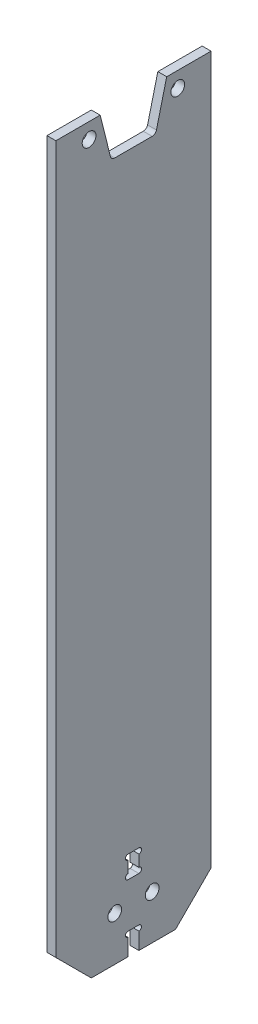
ISO-10303-21;
HEADER;
FILE_DESCRIPTION(('STEP AP214'),'2;1');
FILE_NAME('part.step','',(''),(''),'','','');
FILE_SCHEMA(('AUTOMOTIVE_DESIGN { 1 0 10303 214 1 1 1 1 }'));
ENDSEC;
DATA;
#1=APPLICATION_CONTEXT('core data for automotive mechanical design processes');
#2=APPLICATION_PROTOCOL_DEFINITION('international standard','automotive_design',2000,#1);
#3=PRODUCT_CONTEXT('',#1,'mechanical');
#4=PRODUCT('Part','Part','',(#3));
#5=PRODUCT_RELATED_PRODUCT_CATEGORY('part','',(#4));
#6=PRODUCT_DEFINITION_FORMATION('','',#4);
#7=PRODUCT_DEFINITION_CONTEXT('part definition',#1,'design');
#8=PRODUCT_DEFINITION('design','',#6,#7);
#9=PRODUCT_DEFINITION_SHAPE('','',#8);
#10=(LENGTH_UNIT() NAMED_UNIT(*) SI_UNIT(.MILLI.,.METRE.));
#11=(NAMED_UNIT(*) PLANE_ANGLE_UNIT() SI_UNIT($,.RADIAN.));
#12=(NAMED_UNIT(*) SI_UNIT($,.STERADIAN.) SOLID_ANGLE_UNIT());
#13=UNCERTAINTY_MEASURE_WITH_UNIT(LENGTH_MEASURE(1.E-05),#10,'distance_accuracy_value','');
#14=(GEOMETRIC_REPRESENTATION_CONTEXT(3) GLOBAL_UNCERTAINTY_ASSIGNED_CONTEXT((#13)) GLOBAL_UNIT_ASSIGNED_CONTEXT((#10,
#11,#12)) REPRESENTATION_CONTEXT('',''));
#15=CARTESIAN_POINT('',(0.,0.,0.));
#16=DIRECTION('',(0.,0.,1.));
#17=DIRECTION('',(1.,0.,0.));
#18=AXIS2_PLACEMENT_3D('',#15,#16,#17);
#19=CARTESIAN_POINT('',(1.,83.75,-17.5));
#20=DIRECTION('',(0.,-1.,0.));
#21=DIRECTION('',(0.,0.,-1.));
#22=AXIS2_PLACEMENT_3D('',#19,#20,#21);
#23=PLANE('',#22);
#24=DIRECTION('',(0.,0.,1.));
#25=VECTOR('',#24,1.);
#26=CARTESIAN_POINT('',(1.,83.75,-17.5));
#27=LINE('',#26,#25);
#28=CARTESIAN_POINT('',(1.,83.75,7.5));
#29=VERTEX_POINT('',#28);
#30=CARTESIAN_POINT('',(1.,83.75,17.5));
#31=VERTEX_POINT('',#30);
#32=EDGE_CURVE('E379',#29,#31,#27,.T.);
#33=ORIENTED_EDGE('',*,*,#32,.F.);
#34=DIRECTION('',(1.,0.,0.));
#35=VECTOR('',#34,1.);
#36=CARTESIAN_POINT('',(-1.,83.75,7.5));
#37=LINE('',#36,#35);
#38=CARTESIAN_POINT('',(-1.,83.75,7.5));
#39=VERTEX_POINT('',#38);
#40=EDGE_CURVE('E226',#39,#29,#37,.T.);
#41=ORIENTED_EDGE('',*,*,#40,.F.);
#42=DIRECTION('',(0.,0.,1.));
#43=VECTOR('',#42,1.);
#44=CARTESIAN_POINT('',(-1.,83.75,-17.5));
#45=LINE('',#44,#43);
#46=CARTESIAN_POINT('',(-1.,83.75,17.5));
#47=VERTEX_POINT('',#46);
#48=EDGE_CURVE('E233',#39,#47,#45,.T.);
#49=ORIENTED_EDGE('',*,*,#48,.T.);
#50=DIRECTION('',(-1.,0.,0.));
#51=VECTOR('',#50,1.);
#52=CARTESIAN_POINT('',(1.,83.75,17.5));
#53=LINE('',#52,#51);
#54=EDGE_CURVE('E242',#31,#47,#53,.T.);
#55=ORIENTED_EDGE('',*,*,#54,.F.);
#56=EDGE_LOOP('',(#33,#41,#49,#55));
#57=FACE_BOUND('',#56,.T.);
#58=ADVANCED_FACE('F37',(#57),#23,.F.);
#59=CARTESIAN_POINT('',(1.,-83.75,-17.5));
#60=DIRECTION('',(0.,1.,0.));
#61=DIRECTION('',(0.,0.,1.));
#62=AXIS2_PLACEMENT_3D('',#59,#60,#61);
#63=PLANE('',#62);
#64=DIRECTION('',(0.,0.,-1.));
#65=VECTOR('',#64,1.);
#66=CARTESIAN_POINT('',(1.,-83.75,-17.5));
#67=LINE('',#66,#65);
#68=CARTESIAN_POINT('',(1.,-83.75,9.49999999999999));
#69=VERTEX_POINT('',#68);
#70=CARTESIAN_POINT('',(1.,-83.75,1.22499999999987));
#71=VERTEX_POINT('',#70);
#72=EDGE_CURVE('E370',#69,#71,#67,.T.);
#73=ORIENTED_EDGE('',*,*,#72,.F.);
#74=DIRECTION('',(-1.,0.,0.));
#75=VECTOR('',#74,1.);
#76=CARTESIAN_POINT('',(1.,-83.75,9.49999999999999));
#77=LINE('',#76,#75);
#78=CARTESIAN_POINT('',(-1.,-83.75,9.49999999999999));
#79=VERTEX_POINT('',#78);
#80=EDGE_CURVE('E272',#69,#79,#77,.T.);
#81=ORIENTED_EDGE('',*,*,#80,.T.);
#82=DIRECTION('',(0.,0.,-1.));
#83=VECTOR('',#82,1.);
#84=CARTESIAN_POINT('',(-1.,-83.75,-17.5));
#85=LINE('',#84,#83);
#86=CARTESIAN_POINT('',(-1.,-83.75,1.22499999999987));
#87=VERTEX_POINT('',#86);
#88=EDGE_CURVE('E389',#79,#87,#85,.T.);
#89=ORIENTED_EDGE('',*,*,#88,.T.);
#90=DIRECTION('',(1.,0.,0.));
#91=VECTOR('',#90,1.);
#92=CARTESIAN_POINT('',(-1.,-83.75,1.22499999999987));
#93=LINE('',#92,#91);
#94=EDGE_CURVE('E376',#87,#71,#93,.T.);
#95=ORIENTED_EDGE('',*,*,#94,.T.);
#96=EDGE_LOOP('',(#73,#81,#89,#95));
#97=FACE_BOUND('',#96,.T.);
#98=ADVANCED_FACE('F314',(#97),#63,.F.);
#99=CARTESIAN_POINT('',(1.,-83.75,17.5));
#100=DIRECTION('',(0.,0.,-1.));
#101=DIRECTION('',(-1.,0.,0.));
#102=AXIS2_PLACEMENT_3D('',#99,#100,#101);
#103=PLANE('',#102);
#104=DIRECTION('',(0.,-1.,0.));
#105=VECTOR('',#104,1.);
#106=CARTESIAN_POINT('',(-1.,-83.75,17.5));
#107=LINE('',#106,#105);
#108=CARTESIAN_POINT('',(-1.,-75.75,17.5));
#109=VERTEX_POINT('',#108);
#110=EDGE_CURVE('E385',#47,#109,#107,.T.);
#111=ORIENTED_EDGE('',*,*,#110,.T.);
#112=DIRECTION('',(1.,0.,0.));
#113=VECTOR('',#112,1.);
#114=CARTESIAN_POINT('',(1.,-75.75,17.5));
#115=LINE('',#114,#113);
#116=CARTESIAN_POINT('',(1.,-75.75,17.5));
#117=VERTEX_POINT('',#116);
#118=EDGE_CURVE('E275',#109,#117,#115,.T.);
#119=ORIENTED_EDGE('',*,*,#118,.T.);
#120=DIRECTION('',(0.,-1.,0.));
#121=VECTOR('',#120,1.);
#122=CARTESIAN_POINT('',(1.,-83.75,17.5));
#123=LINE('',#122,#121);
#124=EDGE_CURVE('E232',#31,#117,#123,.T.);
#125=ORIENTED_EDGE('',*,*,#124,.F.);
#126=ORIENTED_EDGE('',*,*,#54,.T.);
#127=EDGE_LOOP('',(#111,#119,#125,#126));
#128=FACE_BOUND('',#127,.T.);
#129=ADVANCED_FACE('F320',(#128),#103,.F.);
#130=CARTESIAN_POINT('',(-1.,-83.75,-1.22499999999987));
#131=VERTEX_POINT('',#130);
#132=CARTESIAN_POINT('',(-1.,-83.75,-9.49999999999999));
#133=VERTEX_POINT('',#132);
#134=EDGE_CURVE('E387',#131,#133,#85,.T.);
#135=ORIENTED_EDGE('',*,*,#134,.T.);
#136=DIRECTION('',(1.,0.,0.));
#137=VECTOR('',#136,1.);
#138=CARTESIAN_POINT('',(1.,-83.75,-9.49999999999999));
#139=LINE('',#138,#137);
#140=CARTESIAN_POINT('',(1.,-83.75,-9.49999999999999));
#141=VERTEX_POINT('',#140);
#142=EDGE_CURVE('E266',#133,#141,#139,.T.);
#143=ORIENTED_EDGE('',*,*,#142,.T.);
#144=CARTESIAN_POINT('',(1.,-83.75,-1.22499999999987));
#145=VERTEX_POINT('',#144);
#146=EDGE_CURVE('E236',#145,#141,#67,.T.);
#147=ORIENTED_EDGE('',*,*,#146,.F.);
#148=DIRECTION('',(1.,0.,0.));
#149=VECTOR('',#148,1.);
#150=CARTESIAN_POINT('',(-1.,-83.75,-1.22499999999987));
#151=LINE('',#150,#149);
#152=EDGE_CURVE('E396',#131,#145,#151,.T.);
#153=ORIENTED_EDGE('',*,*,#152,.F.);
#154=EDGE_LOOP('',(#135,#143,#147,#153));
#155=FACE_BOUND('',#154,.T.);
#156=ADVANCED_FACE('F323',(#155),#63,.F.);
#157=CARTESIAN_POINT('',(1.,-83.75,-17.5));
#158=DIRECTION('',(0.,0.,1.));
#159=DIRECTION('',(1.,0.,0.));
#160=AXIS2_PLACEMENT_3D('',#157,#158,#159);
#161=PLANE('',#160);
#162=DIRECTION('',(0.,1.,0.));
#163=VECTOR('',#162,1.);
#164=CARTESIAN_POINT('',(1.,-83.75,-17.5));
#165=LINE('',#164,#163);
#166=CARTESIAN_POINT('',(1.,-75.75,-17.5));
#167=VERTEX_POINT('',#166);
#168=CARTESIAN_POINT('',(1.,83.75,-17.5));
#169=VERTEX_POINT('',#168);
#170=EDGE_CURVE('E377',#167,#169,#165,.T.);
#171=ORIENTED_EDGE('',*,*,#170,.F.);
#172=DIRECTION('',(-1.,0.,0.));
#173=VECTOR('',#172,1.);
#174=CARTESIAN_POINT('',(1.,-75.75,-17.5));
#175=LINE('',#174,#173);
#176=CARTESIAN_POINT('',(-1.,-75.75,-17.5));
#177=VERTEX_POINT('',#176);
#178=EDGE_CURVE('E259',#167,#177,#175,.T.);
#179=ORIENTED_EDGE('',*,*,#178,.T.);
#180=DIRECTION('',(0.,1.,0.));
#181=VECTOR('',#180,1.);
#182=CARTESIAN_POINT('',(-1.,-83.75,-17.5));
#183=LINE('',#182,#181);
#184=CARTESIAN_POINT('',(-1.,83.75,-17.5));
#185=VERTEX_POINT('',#184);
#186=EDGE_CURVE('E238',#177,#185,#183,.T.);
#187=ORIENTED_EDGE('',*,*,#186,.T.);
#188=DIRECTION('',(-1.,0.,0.));
#189=VECTOR('',#188,1.);
#190=CARTESIAN_POINT('',(1.,83.75,-17.5));
#191=LINE('',#190,#189);
#192=EDGE_CURVE('E231',#169,#185,#191,.T.);
#193=ORIENTED_EDGE('',*,*,#192,.F.);
#194=EDGE_LOOP('',(#171,#179,#187,#193));
#195=FACE_BOUND('',#194,.T.);
#196=ADVANCED_FACE('F328',(#195),#161,.F.);
#197=CARTESIAN_POINT('',(-1.,83.75,-7.5));
#198=VERTEX_POINT('',#197);
#199=EDGE_CURVE('E214',#185,#198,#45,.T.);
#200=ORIENTED_EDGE('',*,*,#199,.T.);
#201=DIRECTION('',(1.,0.,0.));
#202=VECTOR('',#201,1.);
#203=CARTESIAN_POINT('',(-1.,83.75,-7.5));
#204=LINE('',#203,#202);
#205=CARTESIAN_POINT('',(1.,83.75,-7.5));
#206=VERTEX_POINT('',#205);
#207=EDGE_CURVE('E216',#198,#206,#204,.T.);
#208=ORIENTED_EDGE('',*,*,#207,.T.);
#209=EDGE_CURVE('E245',#169,#206,#27,.T.);
#210=ORIENTED_EDGE('',*,*,#209,.F.);
#211=ORIENTED_EDGE('',*,*,#192,.T.);
#212=EDGE_LOOP('',(#200,#208,#210,#211));
#213=FACE_BOUND('',#212,.T.);
#214=ADVANCED_FACE('F229',(#213),#23,.F.);
#215=CARTESIAN_POINT('',(1.,0.,0.));
#216=DIRECTION('',(1.,0.,0.));
#217=DIRECTION('',(0.,0.,-1.));
#218=AXIS2_PLACEMENT_3D('',#215,#216,#217);
#219=PLANE('',#218);
#220=CARTESIAN_POINT('',(1.,80.25,10.));
#221=DIRECTION('',(1.,0.,0.));
#222=DIRECTION('',(0.,0.,-1.));
#223=AXIS2_PLACEMENT_3D('',#220,#221,#222);
#224=CIRCLE('',#223,1.55);
#225=CARTESIAN_POINT('',(1.,80.25,8.45));
#226=VERTEX_POINT('',#225);
#227=EDGE_CURVE('E523',#226,#226,#224,.T.);
#228=ORIENTED_EDGE('',*,*,#227,.F.);
#229=EDGE_LOOP('',(#228));
#230=FACE_BOUND('',#229,.T.);
#231=CARTESIAN_POINT('',(1.,80.25,-10.));
#232=DIRECTION('',(1.,0.,0.));
#233=DIRECTION('',(0.,0.,-1.));
#234=AXIS2_PLACEMENT_3D('',#231,#232,#233);
#235=CIRCLE('',#234,1.55);
#236=CARTESIAN_POINT('',(1.,80.25,-11.55));
#237=VERTEX_POINT('',#236);
#238=EDGE_CURVE('E517',#237,#237,#235,.T.);
#239=ORIENTED_EDGE('',*,*,#238,.F.);
#240=EDGE_LOOP('',(#239));
#241=FACE_BOUND('',#240,.T.);
#242=DIRECTION('',(0.,-0.970142500145332,-0.242535625036333));
#243=VECTOR('',#242,1.);
#244=CARTESIAN_POINT('',(1.,83.75,7.5));
#245=LINE('',#244,#243);
#246=CARTESIAN_POINT('',(1.,74.5074643749637,5.18936609374092));
#247=VERTEX_POINT('',#246);
#248=EDGE_CURVE('E300',#29,#247,#245,.T.);
#249=ORIENTED_EDGE('',*,*,#248,.F.);
#250=ORIENTED_EDGE('',*,*,#32,.T.);
#251=ORIENTED_EDGE('',*,*,#124,.T.);
#252=DIRECTION('',(0.,0.707106781186549,0.707106781186546));
#253=VECTOR('',#252,1.);
#254=CARTESIAN_POINT('',(1.,-46.6249999999999,46.625));
#255=LINE('',#254,#253);
#256=EDGE_CURVE('E268',#117,#69,#255,.F.);
#257=ORIENTED_EDGE('',*,*,#256,.T.);
#258=ORIENTED_EDGE('',*,*,#72,.T.);
#259=DIRECTION('',(0.,-1.,0.));
#260=VECTOR('',#259,1.);
#261=CARTESIAN_POINT('',(1.,-83.75,1.22499999999987));
#262=LINE('',#261,#260);
#263=CARTESIAN_POINT('',(1.,-79.95,1.22500000000007));
#264=VERTEX_POINT('',#263);
#265=EDGE_CURVE('E408',#264,#71,#262,.T.);
#266=ORIENTED_EDGE('',*,*,#265,.F.);
#267=CARTESIAN_POINT('',(1.,-79.35,1.22500000000013));
#268=DIRECTION('',(1.,0.,0.));
#269=DIRECTION('',(0.,0.,-1.));
#270=AXIS2_PLACEMENT_3D('',#267,#268,#269);
#271=CIRCLE('',#270,0.600000000000006);
#272=CARTESIAN_POINT('',(1.,-78.75,1.22500000000013));
#273=VERTEX_POINT('',#272);
#274=EDGE_CURVE('E437',#273,#264,#271,.T.);
#275=ORIENTED_EDGE('',*,*,#274,.F.);
#276=DIRECTION('',(0.,0.,1.));
#277=VECTOR('',#276,1.);
#278=CARTESIAN_POINT('',(1.,-78.75,1.22500000000013));
#279=LINE('',#278,#277);
#280=CARTESIAN_POINT('',(1.,-78.75,-1.22499999999987));
#281=VERTEX_POINT('',#280);
#282=EDGE_CURVE('E407',#281,#273,#279,.T.);
#283=ORIENTED_EDGE('',*,*,#282,.F.);
#284=CARTESIAN_POINT('',(1.,-79.35,-1.22499999999987));
#285=DIRECTION('',(1.,0.,0.));
#286=DIRECTION('',(0.,0.,-1.));
#287=AXIS2_PLACEMENT_3D('',#284,#285,#286);
#288=CIRCLE('',#287,0.600000000000006);
#289=CARTESIAN_POINT('',(1.,-79.95,-1.22499999999987));
#290=VERTEX_POINT('',#289);
#291=EDGE_CURVE('E405',#290,#281,#288,.T.);
#292=ORIENTED_EDGE('',*,*,#291,.F.);
#293=DIRECTION('',(0.,1.,0.));
#294=VECTOR('',#293,1.);
#295=CARTESIAN_POINT('',(1.,-83.75,-1.22499999999987));
#296=LINE('',#295,#294);
#297=EDGE_CURVE('E403',#145,#290,#296,.T.);
#298=ORIENTED_EDGE('',*,*,#297,.F.);
#299=ORIENTED_EDGE('',*,*,#146,.T.);
#300=DIRECTION('',(0.,-0.707106781186546,0.707106781186549));
#301=VECTOR('',#300,1.);
#302=CARTESIAN_POINT('',(1.,-46.6250000000001,-46.625));
#303=LINE('',#302,#301);
#304=EDGE_CURVE('E270',#141,#167,#303,.F.);
#305=ORIENTED_EDGE('',*,*,#304,.T.);
#306=ORIENTED_EDGE('',*,*,#170,.T.);
#307=ORIENTED_EDGE('',*,*,#209,.T.);
#308=DIRECTION('',(0.,0.970142500145332,-0.242535625036333));
#309=VECTOR('',#308,1.);
#310=CARTESIAN_POINT('',(1.,73.75,-5.));
#311=LINE('',#310,#309);
#312=CARTESIAN_POINT('',(1.,74.5074643749637,-5.18936609374092));
#313=VERTEX_POINT('',#312);
#314=EDGE_CURVE('E222',#313,#206,#311,.T.);
#315=ORIENTED_EDGE('',*,*,#314,.F.);
#316=CARTESIAN_POINT('',(1.,74.75,-4.21922359359559));
#317=DIRECTION('',(1.,0.,0.));
#318=DIRECTION('',(0.,0.,-1.));
#319=AXIS2_PLACEMENT_3D('',#316,#317,#318);
#320=CIRCLE('',#319,1.);
#321=CARTESIAN_POINT('',(1.,73.75,-4.21922359359559));
#322=VERTEX_POINT('',#321);
#323=EDGE_CURVE('E45',#313,#322,#320,.F.);
#324=ORIENTED_EDGE('',*,*,#323,.T.);
#325=DIRECTION('',(0.,0.,-1.));
#326=VECTOR('',#325,1.);
#327=CARTESIAN_POINT('',(1.,73.75,5.));
#328=LINE('',#327,#326);
#329=CARTESIAN_POINT('',(1.,73.75,4.21922359359559));
#330=VERTEX_POINT('',#329);
#331=EDGE_CURVE('E295',#330,#322,#328,.T.);
#332=ORIENTED_EDGE('',*,*,#331,.F.);
#333=CARTESIAN_POINT('',(1.,74.75,4.21922359359559));
#334=DIRECTION('',(1.,0.,0.));
#335=DIRECTION('',(0.,0.,-1.));
#336=AXIS2_PLACEMENT_3D('',#333,#334,#335);
#337=CIRCLE('',#336,1.);
#338=EDGE_CURVE('E286',#330,#247,#337,.F.);
#339=ORIENTED_EDGE('',*,*,#338,.T.);
#340=EDGE_LOOP('',(#249,#250,#251,#257,#258,#266,#275,#283,#292,#298,#299,#305,#306,#307,#315,
#324,#332,#339));
#341=FACE_BOUND('',#340,.T.);
#342=CARTESIAN_POINT('',(1.,-73.75,4.22500000000007));
#343=DIRECTION('',(1.,0.,0.));
#344=DIRECTION('',(0.,0.,-1.));
#345=AXIS2_PLACEMENT_3D('',#342,#343,#344);
#346=CIRCLE('',#345,1.54999999999999);
#347=CARTESIAN_POINT('',(1.,-73.75,2.67500000000007));
#348=VERTEX_POINT('',#347);
#349=EDGE_CURVE('E503',#348,#348,#346,.T.);
#350=ORIENTED_EDGE('',*,*,#349,.F.);
#351=EDGE_LOOP('',(#350));
#352=FACE_BOUND('',#351,.T.);
#353=CARTESIAN_POINT('',(1.,-73.75,-4.22500000000007));
#354=DIRECTION('',(1.,0.,0.));
#355=DIRECTION('',(0.,0.,1.));
#356=AXIS2_PLACEMENT_3D('',#353,#354,#355);
#357=CIRCLE('',#356,1.54999999999999);
#358=CARTESIAN_POINT('',(1.,-73.75,-2.67500000000008));
#359=VERTEX_POINT('',#358);
#360=EDGE_CURVE('E497',#359,#359,#357,.T.);
#361=ORIENTED_EDGE('',*,*,#360,.F.);
#362=EDGE_LOOP('',(#361));
#363=FACE_BOUND('',#362,.T.);
#364=CARTESIAN_POINT('',(1.,-68.1,1.22500000000007));
#365=DIRECTION('',(1.,0.,0.));
#366=DIRECTION('',(0.,0.,-1.));
#367=AXIS2_PLACEMENT_3D('',#364,#365,#366);
#368=CIRCLE('',#367,0.600000000000007);
#369=CARTESIAN_POINT('',(1.,-67.5,1.22500000000007));
#370=VERTEX_POINT('',#369);
#371=CARTESIAN_POINT('',(1.,-68.7,1.22500000000007));
#372=VERTEX_POINT('',#371);
#373=EDGE_CURVE('E488',#370,#372,#368,.T.);
#374=ORIENTED_EDGE('',*,*,#373,.F.);
#375=DIRECTION('',(0.,-1.,0.));
#376=VECTOR('',#375,1.);
#377=CARTESIAN_POINT('',(1.,-63.7,1.22500000000007));
#378=LINE('',#377,#376);
#379=CARTESIAN_POINT('',(1.,-64.9,1.22500000000007));
#380=VERTEX_POINT('',#379);
#381=EDGE_CURVE('E457',#380,#370,#378,.T.);
#382=ORIENTED_EDGE('',*,*,#381,.F.);
#383=CARTESIAN_POINT('',(1.,-64.3,1.22500000000007));
#384=DIRECTION('',(1.,0.,0.));
#385=DIRECTION('',(0.,0.,-1.));
#386=AXIS2_PLACEMENT_3D('',#383,#384,#385);
#387=CIRCLE('',#386,0.600000000000007);
#388=CARTESIAN_POINT('',(1.,-63.7,1.22500000000007));
#389=VERTEX_POINT('',#388);
#390=EDGE_CURVE('E477',#389,#380,#387,.T.);
#391=ORIENTED_EDGE('',*,*,#390,.F.);
#392=DIRECTION('',(0.,0.,1.));
#393=VECTOR('',#392,1.);
#394=CARTESIAN_POINT('',(1.,-63.7,-1.22499999999987));
#395=LINE('',#394,#393);
#396=CARTESIAN_POINT('',(1.,-63.7,-1.22499999999987));
#397=VERTEX_POINT('',#396);
#398=EDGE_CURVE('E460',#397,#389,#395,.T.);
#399=ORIENTED_EDGE('',*,*,#398,.F.);
#400=CARTESIAN_POINT('',(1.,-64.3,-1.22499999999987));
#401=DIRECTION('',(1.,0.,0.));
#402=DIRECTION('',(0.,0.,-1.));
#403=AXIS2_PLACEMENT_3D('',#400,#401,#402);
#404=CIRCLE('',#403,0.600000000000007);
#405=CARTESIAN_POINT('',(1.,-64.9,-1.22499999999987));
#406=VERTEX_POINT('',#405);
#407=EDGE_CURVE('E482',#406,#397,#404,.T.);
#408=ORIENTED_EDGE('',*,*,#407,.F.);
#409=DIRECTION('',(0.,1.,0.));
#410=VECTOR('',#409,1.);
#411=CARTESIAN_POINT('',(1.,-68.7,-1.22499999999987));
#412=LINE('',#411,#410);
#413=CARTESIAN_POINT('',(1.,-67.5,-1.22499999999987));
#414=VERTEX_POINT('',#413);
#415=EDGE_CURVE('E450',#414,#406,#412,.T.);
#416=ORIENTED_EDGE('',*,*,#415,.F.);
#417=CARTESIAN_POINT('',(1.,-68.1,-1.22499999999987));
#418=DIRECTION('',(1.,0.,0.));
#419=DIRECTION('',(0.,0.,-1.));
#420=AXIS2_PLACEMENT_3D('',#417,#418,#419);
#421=CIRCLE('',#420,0.600000000000007);
#422=CARTESIAN_POINT('',(1.,-68.7,-1.22499999999987));
#423=VERTEX_POINT('',#422);
#424=EDGE_CURVE('E492',#423,#414,#421,.T.);
#425=ORIENTED_EDGE('',*,*,#424,.F.);
#426=DIRECTION('',(0.,0.,-1.));
#427=VECTOR('',#426,1.);
#428=CARTESIAN_POINT('',(1.,-68.7,1.22500000000007));
#429=LINE('',#428,#427);
#430=EDGE_CURVE('E454',#372,#423,#429,.T.);
#431=ORIENTED_EDGE('',*,*,#430,.F.);
#432=EDGE_LOOP('',(#374,#382,#391,#399,#408,#416,#425,#431));
#433=FACE_BOUND('',#432,.T.);
#434=ADVANCED_FACE('F293',(#230,#241,#341,#352,#363,#433),#219,.T.);
#435=CARTESIAN_POINT('',(-1.,0.,0.));
#436=DIRECTION('',(1.,0.,0.));
#437=DIRECTION('',(0.,0.,-1.));
#438=AXIS2_PLACEMENT_3D('',#435,#436,#437);
#439=PLANE('',#438);
#440=CARTESIAN_POINT('',(-1.,80.25,10.));
#441=DIRECTION('',(1.,0.,0.));
#442=DIRECTION('',(0.,0.,-1.));
#443=AXIS2_PLACEMENT_3D('',#440,#441,#442);
#444=CIRCLE('',#443,1.55);
#445=CARTESIAN_POINT('',(-1.,80.25,8.45));
#446=VERTEX_POINT('',#445);
#447=EDGE_CURVE('E512',#446,#446,#444,.T.);
#448=ORIENTED_EDGE('',*,*,#447,.T.);
#449=EDGE_LOOP('',(#448));
#450=FACE_BOUND('',#449,.T.);
#451=CARTESIAN_POINT('',(-1.,80.25,-10.));
#452=DIRECTION('',(1.,0.,0.));
#453=DIRECTION('',(0.,0.,-1.));
#454=AXIS2_PLACEMENT_3D('',#451,#452,#453);
#455=CIRCLE('',#454,1.55);
#456=CARTESIAN_POINT('',(-1.,80.25,-11.55));
#457=VERTEX_POINT('',#456);
#458=EDGE_CURVE('E520',#457,#457,#455,.T.);
#459=ORIENTED_EDGE('',*,*,#458,.T.);
#460=EDGE_LOOP('',(#459));
#461=FACE_BOUND('',#460,.T.);
#462=ORIENTED_EDGE('',*,*,#48,.F.);
#463=DIRECTION('',(0.,-0.970142500145332,-0.242535625036333));
#464=VECTOR('',#463,1.);
#465=CARTESIAN_POINT('',(-1.,83.75,7.5));
#466=LINE('',#465,#464);
#467=CARTESIAN_POINT('',(-1.,74.5074643749637,5.18936609374092));
#468=VERTEX_POINT('',#467);
#469=EDGE_CURVE('E509',#39,#468,#466,.T.);
#470=ORIENTED_EDGE('',*,*,#469,.T.);
#471=CARTESIAN_POINT('',(-1.,74.75,4.21922359359559));
#472=DIRECTION('',(1.,0.,0.));
#473=DIRECTION('',(0.,0.,-1.));
#474=AXIS2_PLACEMENT_3D('',#471,#472,#473);
#475=CIRCLE('',#474,1.);
#476=CARTESIAN_POINT('',(-1.,73.75,4.21922359359559));
#477=VERTEX_POINT('',#476);
#478=EDGE_CURVE('E288',#468,#477,#475,.T.);
#479=ORIENTED_EDGE('',*,*,#478,.T.);
#480=DIRECTION('',(0.,0.,-1.));
#481=VECTOR('',#480,1.);
#482=CARTESIAN_POINT('',(-1.,73.75,5.));
#483=LINE('',#482,#481);
#484=CARTESIAN_POINT('',(-1.,73.75,-4.21922359359559));
#485=VERTEX_POINT('',#484);
#486=EDGE_CURVE('E217',#477,#485,#483,.T.);
#487=ORIENTED_EDGE('',*,*,#486,.T.);
#488=CARTESIAN_POINT('',(-1.,74.75,-4.21922359359559));
#489=DIRECTION('',(1.,0.,0.));
#490=DIRECTION('',(0.,0.,-1.));
#491=AXIS2_PLACEMENT_3D('',#488,#489,#490);
#492=CIRCLE('',#491,1.);
#493=CARTESIAN_POINT('',(-1.,74.5074643749637,-5.18936609374092));
#494=VERTEX_POINT('',#493);
#495=EDGE_CURVE('E11',#485,#494,#492,.T.);
#496=ORIENTED_EDGE('',*,*,#495,.T.);
#497=DIRECTION('',(0.,0.970142500145332,-0.242535625036333));
#498=VECTOR('',#497,1.);
#499=CARTESIAN_POINT('',(-1.,73.75,-5.));
#500=LINE('',#499,#498);
#501=EDGE_CURVE('E207',#494,#198,#500,.T.);
#502=ORIENTED_EDGE('',*,*,#501,.T.);
#503=ORIENTED_EDGE('',*,*,#199,.F.);
#504=ORIENTED_EDGE('',*,*,#186,.F.);
#505=DIRECTION('',(0.,0.707106781186546,-0.707106781186549));
#506=VECTOR('',#505,1.);
#507=CARTESIAN_POINT('',(-1.,-75.75,-17.5));
#508=LINE('',#507,#506);
#509=EDGE_CURVE('E264',#177,#133,#508,.F.);
#510=ORIENTED_EDGE('',*,*,#509,.T.);
#511=ORIENTED_EDGE('',*,*,#134,.F.);
#512=DIRECTION('',(0.,1.,0.));
#513=VECTOR('',#512,1.);
#514=CARTESIAN_POINT('',(-1.,-83.75,-1.22499999999987));
#515=LINE('',#514,#513);
#516=CARTESIAN_POINT('',(-1.,-79.95,-1.22499999999987));
#517=VERTEX_POINT('',#516);
#518=EDGE_CURVE('E423',#131,#517,#515,.T.);
#519=ORIENTED_EDGE('',*,*,#518,.T.);
#520=CARTESIAN_POINT('',(-1.,-79.35,-1.22499999999987));
#521=DIRECTION('',(1.,0.,0.));
#522=DIRECTION('',(0.,0.,-1.));
#523=AXIS2_PLACEMENT_3D('',#520,#521,#522);
#524=CIRCLE('',#523,0.600000000000006);
#525=CARTESIAN_POINT('',(-1.,-78.75,-1.22499999999987));
#526=VERTEX_POINT('',#525);
#527=EDGE_CURVE('E434',#517,#526,#524,.T.);
#528=ORIENTED_EDGE('',*,*,#527,.T.);
#529=DIRECTION('',(0.,0.,1.));
#530=VECTOR('',#529,1.);
#531=CARTESIAN_POINT('',(-1.,-78.75,1.22500000000013));
#532=LINE('',#531,#530);
#533=CARTESIAN_POINT('',(-1.,-78.75,1.22500000000013));
#534=VERTEX_POINT('',#533);
#535=EDGE_CURVE('E421',#526,#534,#532,.T.);
#536=ORIENTED_EDGE('',*,*,#535,.T.);
#537=CARTESIAN_POINT('',(-1.,-79.35,1.22500000000013));
#538=DIRECTION('',(1.,0.,0.));
#539=DIRECTION('',(0.,0.,-1.));
#540=AXIS2_PLACEMENT_3D('',#537,#538,#539);
#541=CIRCLE('',#540,0.600000000000006);
#542=CARTESIAN_POINT('',(-1.,-79.95,1.22500000000007));
#543=VERTEX_POINT('',#542);
#544=EDGE_CURVE('E432',#534,#543,#541,.T.);
#545=ORIENTED_EDGE('',*,*,#544,.T.);
#546=DIRECTION('',(0.,-1.,0.));
#547=VECTOR('',#546,1.);
#548=CARTESIAN_POINT('',(-1.,-83.75,1.22499999999987));
#549=LINE('',#548,#547);
#550=EDGE_CURVE('E411',#543,#87,#549,.T.);
#551=ORIENTED_EDGE('',*,*,#550,.T.);
#552=ORIENTED_EDGE('',*,*,#88,.F.);
#553=DIRECTION('',(0.,-0.707106781186549,-0.707106781186546));
#554=VECTOR('',#553,1.);
#555=CARTESIAN_POINT('',(-1.,-83.75,9.49999999999999));
#556=LINE('',#555,#554);
#557=EDGE_CURVE('E262',#79,#109,#556,.F.);
#558=ORIENTED_EDGE('',*,*,#557,.T.);
#559=ORIENTED_EDGE('',*,*,#110,.F.);
#560=EDGE_LOOP('',(#462,#470,#479,#487,#496,#502,#503,#504,#510,#511,#519,#528,#536,#545,#551,
#552,#558,#559));
#561=FACE_BOUND('',#560,.T.);
#562=CARTESIAN_POINT('',(-1.,-73.75,4.22500000000007));
#563=DIRECTION('',(1.,0.,0.));
#564=DIRECTION('',(0.,0.,-1.));
#565=AXIS2_PLACEMENT_3D('',#562,#563,#564);
#566=CIRCLE('',#565,1.54999999999999);
#567=CARTESIAN_POINT('',(-1.,-73.75,2.67500000000007));
#568=VERTEX_POINT('',#567);
#569=EDGE_CURVE('E494',#568,#568,#566,.T.);
#570=ORIENTED_EDGE('',*,*,#569,.T.);
#571=EDGE_LOOP('',(#570));
#572=FACE_BOUND('',#571,.T.);
#573=CARTESIAN_POINT('',(-1.,-73.75,-4.22500000000007));
#574=DIRECTION('',(1.,0.,0.));
#575=DIRECTION('',(0.,0.,1.));
#576=AXIS2_PLACEMENT_3D('',#573,#574,#575);
#577=CIRCLE('',#576,1.54999999999999);
#578=CARTESIAN_POINT('',(-1.,-73.75,-2.67500000000008));
#579=VERTEX_POINT('',#578);
#580=EDGE_CURVE('E500',#579,#579,#577,.T.);
#581=ORIENTED_EDGE('',*,*,#580,.T.);
#582=EDGE_LOOP('',(#581));
#583=FACE_BOUND('',#582,.T.);
#584=DIRECTION('',(0.,-1.,0.));
#585=VECTOR('',#584,1.);
#586=CARTESIAN_POINT('',(-1.,-63.7,1.22500000000007));
#587=LINE('',#586,#585);
#588=CARTESIAN_POINT('',(-1.,-64.9,1.22500000000007));
#589=VERTEX_POINT('',#588);
#590=CARTESIAN_POINT('',(-1.,-67.5,1.22500000000007));
#591=VERTEX_POINT('',#590);
#592=EDGE_CURVE('E469',#589,#591,#587,.T.);
#593=ORIENTED_EDGE('',*,*,#592,.T.);
#594=CARTESIAN_POINT('',(-1.,-68.1,1.22500000000007));
#595=DIRECTION('',(1.,0.,0.));
#596=DIRECTION('',(0.,0.,-1.));
#597=AXIS2_PLACEMENT_3D('',#594,#595,#596);
#598=CIRCLE('',#597,0.600000000000007);
#599=CARTESIAN_POINT('',(-1.,-68.7,1.22500000000007));
#600=VERTEX_POINT('',#599);
#601=EDGE_CURVE('E479',#591,#600,#598,.T.);
#602=ORIENTED_EDGE('',*,*,#601,.T.);
#603=DIRECTION('',(0.,0.,-1.));
#604=VECTOR('',#603,1.);
#605=CARTESIAN_POINT('',(-1.,-68.7,1.22500000000007));
#606=LINE('',#605,#604);
#607=CARTESIAN_POINT('',(-1.,-68.7,-1.22499999999987));
#608=VERTEX_POINT('',#607);
#609=EDGE_CURVE('E466',#600,#608,#606,.T.);
#610=ORIENTED_EDGE('',*,*,#609,.T.);
#611=CARTESIAN_POINT('',(-1.,-68.1,-1.22499999999987));
#612=DIRECTION('',(1.,0.,0.));
#613=DIRECTION('',(0.,0.,-1.));
#614=AXIS2_PLACEMENT_3D('',#611,#612,#613);
#615=CIRCLE('',#614,0.600000000000007);
#616=CARTESIAN_POINT('',(-1.,-67.5,-1.22499999999987));
#617=VERTEX_POINT('',#616);
#618=EDGE_CURVE('E485',#608,#617,#615,.T.);
#619=ORIENTED_EDGE('',*,*,#618,.T.);
#620=DIRECTION('',(0.,1.,0.));
#621=VECTOR('',#620,1.);
#622=CARTESIAN_POINT('',(-1.,-68.7,-1.22499999999987));
#623=LINE('',#622,#621);
#624=CARTESIAN_POINT('',(-1.,-64.9,-1.22499999999987));
#625=VERTEX_POINT('',#624);
#626=EDGE_CURVE('E443',#617,#625,#623,.T.);
#627=ORIENTED_EDGE('',*,*,#626,.T.);
#628=CARTESIAN_POINT('',(-1.,-64.3,-1.22499999999987));
#629=DIRECTION('',(1.,0.,0.));
#630=DIRECTION('',(0.,0.,-1.));
#631=AXIS2_PLACEMENT_3D('',#628,#629,#630);
#632=CIRCLE('',#631,0.600000000000007);
#633=CARTESIAN_POINT('',(-1.,-63.7,-1.22499999999987));
#634=VERTEX_POINT('',#633);
#635=EDGE_CURVE('E484',#625,#634,#632,.T.);
#636=ORIENTED_EDGE('',*,*,#635,.T.);
#637=DIRECTION('',(0.,0.,1.));
#638=VECTOR('',#637,1.);
#639=CARTESIAN_POINT('',(-1.,-63.7,-1.22499999999987));
#640=LINE('',#639,#638);
#641=CARTESIAN_POINT('',(-1.,-63.7,1.22500000000007));
#642=VERTEX_POINT('',#641);
#643=EDGE_CURVE('E453',#634,#642,#640,.T.);
#644=ORIENTED_EDGE('',*,*,#643,.T.);
#645=CARTESIAN_POINT('',(-1.,-64.3,1.22500000000007));
#646=DIRECTION('',(1.,0.,0.));
#647=DIRECTION('',(0.,0.,-1.));
#648=AXIS2_PLACEMENT_3D('',#645,#646,#647);
#649=CIRCLE('',#648,0.600000000000007);
#650=EDGE_CURVE('E476',#642,#589,#649,.T.);
#651=ORIENTED_EDGE('',*,*,#650,.T.);
#652=EDGE_LOOP('',(#593,#602,#610,#619,#627,#636,#644,#651));
#653=FACE_BOUND('',#652,.T.);
#654=ADVANCED_FACE('F210',(#450,#461,#561,#572,#583,#653),#439,.F.);
#655=CARTESIAN_POINT('',(-1.,-83.75,1.22499999999987));
#656=DIRECTION('',(0.,0.,1.));
#657=DIRECTION('',(0.,-1.,0.));
#658=AXIS2_PLACEMENT_3D('',#655,#656,#657);
#659=PLANE('',#658);
#660=ORIENTED_EDGE('',*,*,#550,.F.);
#661=DIRECTION('',(1.,0.,0.));
#662=VECTOR('',#661,1.);
#663=CARTESIAN_POINT('',(-1.,-79.95,1.22500000000007));
#664=LINE('',#663,#662);
#665=EDGE_CURVE('E413',#543,#264,#664,.T.);
#666=ORIENTED_EDGE('',*,*,#665,.T.);
#667=ORIENTED_EDGE('',*,*,#265,.T.);
#668=ORIENTED_EDGE('',*,*,#94,.F.);
#669=EDGE_LOOP('',(#660,#666,#667,#668));
#670=FACE_BOUND('',#669,.T.);
#671=ADVANCED_FACE('F596',(#670),#659,.F.);
#672=CARTESIAN_POINT('',(-1.,-78.75,1.22500000000013));
#673=DIRECTION('',(0.,1.,0.));
#674=DIRECTION('',(0.,0.,1.));
#675=AXIS2_PLACEMENT_3D('',#672,#673,#674);
#676=PLANE('',#675);
#677=ORIENTED_EDGE('',*,*,#282,.T.);
#678=DIRECTION('',(1.,0.,0.));
#679=VECTOR('',#678,1.);
#680=CARTESIAN_POINT('',(-1.,-78.75,1.22500000000013));
#681=LINE('',#680,#679);
#682=EDGE_CURVE('E388',#534,#273,#681,.T.);
#683=ORIENTED_EDGE('',*,*,#682,.F.);
#684=ORIENTED_EDGE('',*,*,#535,.F.);
#685=DIRECTION('',(1.,0.,0.));
#686=VECTOR('',#685,1.);
#687=CARTESIAN_POINT('',(-1.,-78.75,-1.22499999999987));
#688=LINE('',#687,#686);
#689=EDGE_CURVE('E418',#526,#281,#688,.T.);
#690=ORIENTED_EDGE('',*,*,#689,.T.);
#691=EDGE_LOOP('',(#677,#683,#684,#690));
#692=FACE_BOUND('',#691,.T.);
#693=ADVANCED_FACE('F593',(#692),#676,.F.);
#694=CARTESIAN_POINT('',(-1.,-83.75,-1.22499999999987));
#695=DIRECTION('',(0.,0.,-1.));
#696=DIRECTION('',(-1.,0.,0.));
#697=AXIS2_PLACEMENT_3D('',#694,#695,#696);
#698=PLANE('',#697);
#699=ORIENTED_EDGE('',*,*,#297,.T.);
#700=DIRECTION('',(1.,0.,0.));
#701=VECTOR('',#700,1.);
#702=CARTESIAN_POINT('',(-1.,-79.95,-1.22499999999987));
#703=LINE('',#702,#701);
#704=EDGE_CURVE('E247',#290,#517,#703,.F.);
#705=ORIENTED_EDGE('',*,*,#704,.T.);
#706=ORIENTED_EDGE('',*,*,#518,.F.);
#707=ORIENTED_EDGE('',*,*,#152,.T.);
#708=EDGE_LOOP('',(#699,#705,#706,#707));
#709=FACE_BOUND('',#708,.T.);
#710=ADVANCED_FACE('F591',(#709),#698,.F.);
#711=CARTESIAN_POINT('',(-1.,-79.35,-1.22499999999987));
#712=DIRECTION('',(1.,0.,0.));
#713=DIRECTION('',(0.,0.,-1.));
#714=AXIS2_PLACEMENT_3D('',#711,#712,#713);
#715=CYLINDRICAL_SURFACE('',#714,0.600000000000006);
#716=ORIENTED_EDGE('',*,*,#527,.F.);
#717=ORIENTED_EDGE('',*,*,#704,.F.);
#718=ORIENTED_EDGE('',*,*,#291,.T.);
#719=ORIENTED_EDGE('',*,*,#689,.F.);
#720=EDGE_LOOP('',(#716,#717,#718,#719));
#721=FACE_BOUND('',#720,.T.);
#722=ADVANCED_FACE('F587',(#721),#715,.F.);
#723=CARTESIAN_POINT('',(-1.,-79.35,1.22500000000013));
#724=DIRECTION('',(1.,0.,0.));
#725=DIRECTION('',(0.,0.,-1.));
#726=AXIS2_PLACEMENT_3D('',#723,#724,#725);
#727=CYLINDRICAL_SURFACE('',#726,0.600000000000006);
#728=ORIENTED_EDGE('',*,*,#544,.F.);
#729=ORIENTED_EDGE('',*,*,#682,.T.);
#730=ORIENTED_EDGE('',*,*,#274,.T.);
#731=ORIENTED_EDGE('',*,*,#665,.F.);
#732=EDGE_LOOP('',(#728,#729,#730,#731));
#733=FACE_BOUND('',#732,.T.);
#734=ADVANCED_FACE('F583',(#733),#727,.F.);
#735=CARTESIAN_POINT('',(-1.,-63.7,-1.22499999999987));
#736=DIRECTION('',(0.,1.,0.));
#737=DIRECTION('',(0.,0.,1.));
#738=AXIS2_PLACEMENT_3D('',#735,#736,#737);
#739=PLANE('',#738);
#740=ORIENTED_EDGE('',*,*,#398,.T.);
#741=DIRECTION('',(1.,0.,0.));
#742=VECTOR('',#741,1.);
#743=CARTESIAN_POINT('',(-1.,-63.7,1.22500000000007));
#744=LINE('',#743,#742);
#745=EDGE_CURVE('E440',#642,#389,#744,.T.);
#746=ORIENTED_EDGE('',*,*,#745,.F.);
#747=ORIENTED_EDGE('',*,*,#643,.F.);
#748=DIRECTION('',(1.,0.,0.));
#749=VECTOR('',#748,1.);
#750=CARTESIAN_POINT('',(-1.,-63.7,-1.22499999999987));
#751=LINE('',#750,#749);
#752=EDGE_CURVE('E435',#634,#397,#751,.T.);
#753=ORIENTED_EDGE('',*,*,#752,.T.);
#754=EDGE_LOOP('',(#740,#746,#747,#753));
#755=FACE_BOUND('',#754,.T.);
#756=ADVANCED_FACE('F573',(#755),#739,.F.);
#757=CARTESIAN_POINT('',(-1.,-68.7,-1.22499999999987));
#758=DIRECTION('',(0.,0.,-1.));
#759=DIRECTION('',(0.,1.,0.));
#760=AXIS2_PLACEMENT_3D('',#757,#758,#759);
#761=PLANE('',#760);
#762=ORIENTED_EDGE('',*,*,#415,.T.);
#763=DIRECTION('',(1.,0.,0.));
#764=VECTOR('',#763,1.);
#765=CARTESIAN_POINT('',(-1.,-64.9,-1.22499999999987));
#766=LINE('',#765,#764);
#767=EDGE_CURVE('E256',#406,#625,#766,.F.);
#768=ORIENTED_EDGE('',*,*,#767,.T.);
#769=ORIENTED_EDGE('',*,*,#626,.F.);
#770=DIRECTION('',(1.,0.,0.));
#771=VECTOR('',#770,1.);
#772=CARTESIAN_POINT('',(-1.,-67.5,-1.22499999999987));
#773=LINE('',#772,#771);
#774=EDGE_CURVE('E463',#617,#414,#773,.T.);
#775=ORIENTED_EDGE('',*,*,#774,.T.);
#776=EDGE_LOOP('',(#762,#768,#769,#775));
#777=FACE_BOUND('',#776,.T.);
#778=ADVANCED_FACE('F569',(#777),#761,.F.);
#779=CARTESIAN_POINT('',(-1.,-68.7,1.22500000000007));
#780=DIRECTION('',(0.,-1.,0.));
#781=DIRECTION('',(0.,0.,-1.));
#782=AXIS2_PLACEMENT_3D('',#779,#780,#781);
#783=PLANE('',#782);
#784=ORIENTED_EDGE('',*,*,#430,.T.);
#785=DIRECTION('',(1.,0.,0.));
#786=VECTOR('',#785,1.);
#787=CARTESIAN_POINT('',(-1.,-68.7,-1.22499999999987));
#788=LINE('',#787,#786);
#789=EDGE_CURVE('E446',#608,#423,#788,.T.);
#790=ORIENTED_EDGE('',*,*,#789,.F.);
#791=ORIENTED_EDGE('',*,*,#609,.F.);
#792=DIRECTION('',(1.,0.,0.));
#793=VECTOR('',#792,1.);
#794=CARTESIAN_POINT('',(-1.,-68.7,1.22500000000007));
#795=LINE('',#794,#793);
#796=EDGE_CURVE('E442',#600,#372,#795,.T.);
#797=ORIENTED_EDGE('',*,*,#796,.T.);
#798=EDGE_LOOP('',(#784,#790,#791,#797));
#799=FACE_BOUND('',#798,.T.);
#800=ADVANCED_FACE('F572',(#799),#783,.F.);
#801=CARTESIAN_POINT('',(-1.,-63.7,1.22500000000007));
#802=DIRECTION('',(0.,0.,1.));
#803=DIRECTION('',(0.,-1.,0.));
#804=AXIS2_PLACEMENT_3D('',#801,#802,#803);
#805=PLANE('',#804);
#806=ORIENTED_EDGE('',*,*,#381,.T.);
#807=DIRECTION('',(1.,0.,0.));
#808=VECTOR('',#807,1.);
#809=CARTESIAN_POINT('',(-1.,-67.5,1.22500000000007));
#810=LINE('',#809,#808);
#811=EDGE_CURVE('E253',#370,#591,#810,.F.);
#812=ORIENTED_EDGE('',*,*,#811,.T.);
#813=ORIENTED_EDGE('',*,*,#592,.F.);
#814=DIRECTION('',(1.,0.,0.));
#815=VECTOR('',#814,1.);
#816=CARTESIAN_POINT('',(-1.,-64.9,1.22500000000007));
#817=LINE('',#816,#815);
#818=EDGE_CURVE('E250',#589,#380,#817,.T.);
#819=ORIENTED_EDGE('',*,*,#818,.T.);
#820=EDGE_LOOP('',(#806,#812,#813,#819));
#821=FACE_BOUND('',#820,.T.);
#822=ADVANCED_FACE('F567',(#821),#805,.F.);
#823=CARTESIAN_POINT('',(-1.,-64.3,1.22500000000007));
#824=DIRECTION('',(1.,0.,0.));
#825=DIRECTION('',(0.,0.,-1.));
#826=AXIS2_PLACEMENT_3D('',#823,#824,#825);
#827=CYLINDRICAL_SURFACE('',#826,0.600000000000007);
#828=ORIENTED_EDGE('',*,*,#650,.F.);
#829=ORIENTED_EDGE('',*,*,#745,.T.);
#830=ORIENTED_EDGE('',*,*,#390,.T.);
#831=ORIENTED_EDGE('',*,*,#818,.F.);
#832=EDGE_LOOP('',(#828,#829,#830,#831));
#833=FACE_BOUND('',#832,.T.);
#834=ADVANCED_FACE('F560',(#833),#827,.F.);
#835=CARTESIAN_POINT('',(-1.,-68.1,1.22500000000007));
#836=DIRECTION('',(1.,0.,0.));
#837=DIRECTION('',(0.,0.,-1.));
#838=AXIS2_PLACEMENT_3D('',#835,#836,#837);
#839=CYLINDRICAL_SURFACE('',#838,0.600000000000007);
#840=ORIENTED_EDGE('',*,*,#601,.F.);
#841=ORIENTED_EDGE('',*,*,#811,.F.);
#842=ORIENTED_EDGE('',*,*,#373,.T.);
#843=ORIENTED_EDGE('',*,*,#796,.F.);
#844=EDGE_LOOP('',(#840,#841,#842,#843));
#845=FACE_BOUND('',#844,.T.);
#846=ADVANCED_FACE('F556',(#845),#839,.F.);
#847=CARTESIAN_POINT('',(-1.,-68.1,-1.22499999999987));
#848=DIRECTION('',(1.,0.,0.));
#849=DIRECTION('',(0.,0.,-1.));
#850=AXIS2_PLACEMENT_3D('',#847,#848,#849);
#851=CYLINDRICAL_SURFACE('',#850,0.600000000000007);
#852=ORIENTED_EDGE('',*,*,#618,.F.);
#853=ORIENTED_EDGE('',*,*,#789,.T.);
#854=ORIENTED_EDGE('',*,*,#424,.T.);
#855=ORIENTED_EDGE('',*,*,#774,.F.);
#856=EDGE_LOOP('',(#852,#853,#854,#855));
#857=FACE_BOUND('',#856,.T.);
#858=ADVANCED_FACE('F553',(#857),#851,.F.);
#859=CARTESIAN_POINT('',(-1.,-64.3,-1.22499999999987));
#860=DIRECTION('',(1.,0.,0.));
#861=DIRECTION('',(0.,0.,-1.));
#862=AXIS2_PLACEMENT_3D('',#859,#860,#861);
#863=CYLINDRICAL_SURFACE('',#862,0.600000000000007);
#864=ORIENTED_EDGE('',*,*,#635,.F.);
#865=ORIENTED_EDGE('',*,*,#767,.F.);
#866=ORIENTED_EDGE('',*,*,#407,.T.);
#867=ORIENTED_EDGE('',*,*,#752,.F.);
#868=EDGE_LOOP('',(#864,#865,#866,#867));
#869=FACE_BOUND('',#868,.T.);
#870=ADVANCED_FACE('F551',(#869),#863,.F.);
#871=CARTESIAN_POINT('',(-1.,-73.75,-4.22500000000007));
#872=DIRECTION('',(1.,0.,0.));
#873=DIRECTION('',(0.,0.,-1.));
#874=AXIS2_PLACEMENT_3D('',#871,#872,#873);
#875=CYLINDRICAL_SURFACE('',#874,1.54999999999999);
#876=ORIENTED_EDGE('',*,*,#580,.F.);
#877=EDGE_LOOP('',(#876));
#878=FACE_BOUND('',#877,.T.);
#879=ORIENTED_EDGE('',*,*,#360,.T.);
#880=EDGE_LOOP('',(#879));
#881=FACE_BOUND('',#880,.T.);
#882=ADVANCED_FACE('F547',(#878,#881),#875,.F.);
#883=CARTESIAN_POINT('',(-1.,-73.75,4.22500000000007));
#884=DIRECTION('',(1.,0.,0.));
#885=DIRECTION('',(0.,0.,-1.));
#886=AXIS2_PLACEMENT_3D('',#883,#884,#885);
#887=CYLINDRICAL_SURFACE('',#886,1.54999999999999);
#888=ORIENTED_EDGE('',*,*,#569,.F.);
#889=EDGE_LOOP('',(#888));
#890=FACE_BOUND('',#889,.T.);
#891=ORIENTED_EDGE('',*,*,#349,.T.);
#892=EDGE_LOOP('',(#891));
#893=FACE_BOUND('',#892,.T.);
#894=ADVANCED_FACE('F353',(#890,#893),#887,.F.);
#895=CARTESIAN_POINT('',(1.,-75.75,-17.5));
#896=DIRECTION('',(0.,0.707106781186549,0.707106781186546));
#897=DIRECTION('',(-1.,0.,0.));
#898=AXIS2_PLACEMENT_3D('',#895,#896,#897);
#899=PLANE('',#898);
#900=ORIENTED_EDGE('',*,*,#304,.F.);
#901=ORIENTED_EDGE('',*,*,#142,.F.);
#902=ORIENTED_EDGE('',*,*,#509,.F.);
#903=ORIENTED_EDGE('',*,*,#178,.F.);
#904=EDGE_LOOP('',(#900,#901,#902,#903));
#905=FACE_BOUND('',#904,.T.);
#906=ADVANCED_FACE('F346',(#905),#899,.F.);
#907=CARTESIAN_POINT('',(1.,-83.75,9.49999999999999));
#908=DIRECTION('',(0.,0.707106781186546,-0.707106781186549));
#909=DIRECTION('',(-1.,0.,0.));
#910=AXIS2_PLACEMENT_3D('',#907,#908,#909);
#911=PLANE('',#910);
#912=ORIENTED_EDGE('',*,*,#256,.F.);
#913=ORIENTED_EDGE('',*,*,#118,.F.);
#914=ORIENTED_EDGE('',*,*,#557,.F.);
#915=ORIENTED_EDGE('',*,*,#80,.F.);
#916=EDGE_LOOP('',(#912,#913,#914,#915));
#917=FACE_BOUND('',#916,.T.);
#918=ADVANCED_FACE('F352',(#917),#911,.F.);
#919=CARTESIAN_POINT('',(-1.,83.75,7.5));
#920=DIRECTION('',(0.,-0.242535625036333,0.970142500145332));
#921=DIRECTION('',(0.,-0.970142500145332,-0.242535625036333));
#922=AXIS2_PLACEMENT_3D('',#919,#920,#921);
#923=PLANE('',#922);
#924=ORIENTED_EDGE('',*,*,#248,.T.);
#925=DIRECTION('',(1.,0.,0.));
#926=VECTOR('',#925,1.);
#927=CARTESIAN_POINT('',(-1.,74.5074643749637,5.18936609374092));
#928=LINE('',#927,#926);
#929=EDGE_CURVE('E282',#247,#468,#928,.F.);
#930=ORIENTED_EDGE('',*,*,#929,.T.);
#931=ORIENTED_EDGE('',*,*,#469,.F.);
#932=ORIENTED_EDGE('',*,*,#40,.T.);
#933=EDGE_LOOP('',(#924,#930,#931,#932));
#934=FACE_BOUND('',#933,.T.);
#935=ADVANCED_FACE('F358',(#934),#923,.F.);
#936=CARTESIAN_POINT('',(-1.,73.75,-5.));
#937=DIRECTION('',(0.,-0.242535625036333,-0.970142500145332));
#938=DIRECTION('',(0.,0.970142500145332,-0.242535625036333));
#939=AXIS2_PLACEMENT_3D('',#936,#937,#938);
#940=PLANE('',#939);
#941=ORIENTED_EDGE('',*,*,#501,.F.);
#942=DIRECTION('',(1.,0.,0.));
#943=VECTOR('',#942,1.);
#944=CARTESIAN_POINT('',(1.,74.5074643749637,-5.18936609374092));
#945=LINE('',#944,#943);
#946=EDGE_CURVE('E284',#494,#313,#945,.T.);
#947=ORIENTED_EDGE('',*,*,#946,.T.);
#948=ORIENTED_EDGE('',*,*,#314,.T.);
#949=ORIENTED_EDGE('',*,*,#207,.F.);
#950=EDGE_LOOP('',(#941,#947,#948,#949));
#951=FACE_BOUND('',#950,.T.);
#952=ADVANCED_FACE('F220',(#951),#940,.F.);
#953=CARTESIAN_POINT('',(-1.,73.75,5.));
#954=DIRECTION('',(0.,-1.,0.));
#955=DIRECTION('',(0.,0.,-1.));
#956=AXIS2_PLACEMENT_3D('',#953,#954,#955);
#957=PLANE('',#956);
#958=ORIENTED_EDGE('',*,*,#486,.F.);
#959=DIRECTION('',(1.,0.,0.));
#960=VECTOR('',#959,1.);
#961=CARTESIAN_POINT('',(1.,73.75,4.21922359359559));
#962=LINE('',#961,#960);
#963=EDGE_CURVE('E279',#477,#330,#962,.T.);
#964=ORIENTED_EDGE('',*,*,#963,.T.);
#965=ORIENTED_EDGE('',*,*,#331,.T.);
#966=DIRECTION('',(1.,0.,0.));
#967=VECTOR('',#966,1.);
#968=CARTESIAN_POINT('',(-1.,73.75,-4.21922359359559));
#969=LINE('',#968,#967);
#970=EDGE_CURVE('E277',#322,#485,#969,.F.);
#971=ORIENTED_EDGE('',*,*,#970,.T.);
#972=EDGE_LOOP('',(#958,#964,#965,#971));
#973=FACE_BOUND('',#972,.T.);
#974=ADVANCED_FACE('F298',(#973),#957,.F.);
#975=CARTESIAN_POINT('',(-1.,74.75,4.21922359359559));
#976=DIRECTION('',(-1.,0.,0.));
#977=DIRECTION('',(0.,0.,1.));
#978=AXIS2_PLACEMENT_3D('',#975,#976,#977);
#979=CYLINDRICAL_SURFACE('',#978,1.);
#980=ORIENTED_EDGE('',*,*,#478,.F.);
#981=ORIENTED_EDGE('',*,*,#929,.F.);
#982=ORIENTED_EDGE('',*,*,#338,.F.);
#983=ORIENTED_EDGE('',*,*,#963,.F.);
#984=EDGE_LOOP('',(#980,#981,#982,#983));
#985=FACE_BOUND('',#984,.T.);
#986=ADVANCED_FACE('F304',(#985),#979,.F.);
#987=CARTESIAN_POINT('',(-1.,74.75,-4.21922359359559));
#988=DIRECTION('',(-1.,0.,0.));
#989=DIRECTION('',(0.,0.,1.));
#990=AXIS2_PLACEMENT_3D('',#987,#988,#989);
#991=CYLINDRICAL_SURFACE('',#990,1.);
#992=ORIENTED_EDGE('',*,*,#495,.F.);
#993=ORIENTED_EDGE('',*,*,#970,.F.);
#994=ORIENTED_EDGE('',*,*,#323,.F.);
#995=ORIENTED_EDGE('',*,*,#946,.F.);
#996=EDGE_LOOP('',(#992,#993,#994,#995));
#997=FACE_BOUND('',#996,.T.);
#998=ADVANCED_FACE('F39',(#997),#991,.F.);
#999=CARTESIAN_POINT('',(-1.,80.25,-10.));
#1000=DIRECTION('',(1.,0.,0.));
#1001=DIRECTION('',(0.,0.,-1.));
#1002=AXIS2_PLACEMENT_3D('',#999,#1000,#1001);
#1003=CYLINDRICAL_SURFACE('',#1002,1.55);
#1004=ORIENTED_EDGE('',*,*,#458,.F.);
#1005=EDGE_LOOP('',(#1004));
#1006=FACE_BOUND('',#1005,.T.);
#1007=ORIENTED_EDGE('',*,*,#238,.T.);
#1008=EDGE_LOOP('',(#1007));
#1009=FACE_BOUND('',#1008,.T.);
#1010=ADVANCED_FACE('F303',(#1006,#1009),#1003,.F.);
#1011=CARTESIAN_POINT('',(-1.,80.25,10.));
#1012=DIRECTION('',(1.,0.,0.));
#1013=DIRECTION('',(0.,0.,-1.));
#1014=AXIS2_PLACEMENT_3D('',#1011,#1012,#1013);
#1015=CYLINDRICAL_SURFACE('',#1014,1.55);
#1016=ORIENTED_EDGE('',*,*,#447,.F.);
#1017=EDGE_LOOP('',(#1016));
#1018=FACE_BOUND('',#1017,.T.);
#1019=ORIENTED_EDGE('',*,*,#227,.T.);
#1020=EDGE_LOOP('',(#1019));
#1021=FACE_BOUND('',#1020,.T.);
#1022=ADVANCED_FACE('F309',(#1018,#1021),#1015,.F.);
#1023=CLOSED_SHELL('',(#58,#98,#129,#156,#196,#214,#434,#654,#671,#693,#710,#722,#734,#756,#778,
#800,#822,#834,#846,#858,#870,#882,#894,#906,#918,#935,#952,#974,#986,#998,#1010,#1022));
#1024=MANIFOLD_SOLID_BREP('B2',#1023);
#1025=ADVANCED_BREP_SHAPE_REPRESENTATION('',(#18,#1024),#14);
#1026=SHAPE_DEFINITION_REPRESENTATION(#9,#1025);
ENDSEC;
END-ISO-10303-21;
